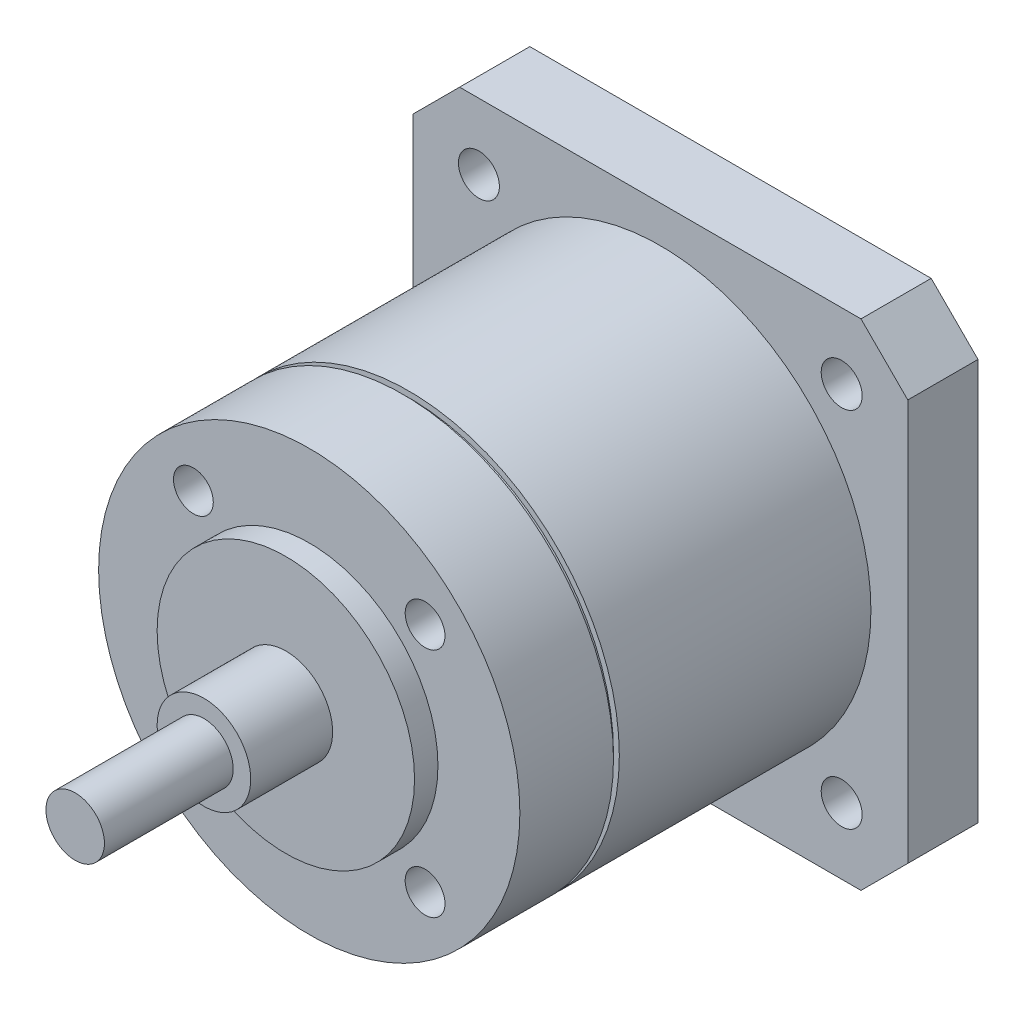
ISO-10303-21;
HEADER;
FILE_DESCRIPTION(('STEP AP214'),'2;1');
FILE_NAME('part.step','',(''),(''),'','','');
FILE_SCHEMA(('AUTOMOTIVE_DESIGN { 1 0 10303 214 1 1 1 1 }'));
ENDSEC;
DATA;
#1=APPLICATION_CONTEXT('core data for automotive mechanical design processes');
#2=APPLICATION_PROTOCOL_DEFINITION('international standard','automotive_design',2000,#1);
#3=PRODUCT_CONTEXT('',#1,'mechanical');
#4=PRODUCT('Part','Part','',(#3));
#5=PRODUCT_RELATED_PRODUCT_CATEGORY('part','',(#4));
#6=PRODUCT_DEFINITION_FORMATION('','',#4);
#7=PRODUCT_DEFINITION_CONTEXT('part definition',#1,'design');
#8=PRODUCT_DEFINITION('design','',#6,#7);
#9=PRODUCT_DEFINITION_SHAPE('','',#8);
#10=(LENGTH_UNIT() NAMED_UNIT(*) SI_UNIT(.MILLI.,.METRE.));
#11=(NAMED_UNIT(*) PLANE_ANGLE_UNIT() SI_UNIT($,.RADIAN.));
#12=(NAMED_UNIT(*) SI_UNIT($,.STERADIAN.) SOLID_ANGLE_UNIT());
#13=UNCERTAINTY_MEASURE_WITH_UNIT(LENGTH_MEASURE(1.E-05),#10,'distance_accuracy_value','');
#14=(GEOMETRIC_REPRESENTATION_CONTEXT(3) GLOBAL_UNCERTAINTY_ASSIGNED_CONTEXT((#13)) GLOBAL_UNIT_ASSIGNED_CONTEXT((#10,
#11,#12)) REPRESENTATION_CONTEXT('',''));
#15=CARTESIAN_POINT('',(0.,0.,0.));
#16=DIRECTION('',(0.,0.,1.));
#17=DIRECTION('',(1.,0.,0.));
#18=AXIS2_PLACEMENT_3D('',#15,#16,#17);
#19=CARTESIAN_POINT('',(0.,0.,56.));
#20=DIRECTION('',(0.,0.,1.));
#21=DIRECTION('',(1.,0.,0.));
#22=AXIS2_PLACEMENT_3D('',#19,#20,#21);
#23=PLANE('',#22);
#24=CARTESIAN_POINT('',(0.,0.,56.));
#25=DIRECTION('',(0.,0.,1.));
#26=DIRECTION('',(1.,0.,0.));
#27=AXIS2_PLACEMENT_3D('',#24,#25,#26);
#28=CIRCLE('',#27,2.5);
#29=CARTESIAN_POINT('',(2.5,0.,56.));
#30=VERTEX_POINT('',#29);
#31=EDGE_CURVE('E20',#30,#30,#28,.F.);
#32=ORIENTED_EDGE('',*,*,#31,.F.);
#33=EDGE_LOOP('',(#32));
#34=FACE_BOUND('',#33,.T.);
#35=ADVANCED_FACE('F17',(#34),#23,.T.);
#36=CARTESIAN_POINT('',(0.,0.,45.));
#37=DIRECTION('',(0.,0.,1.));
#38=DIRECTION('',(1.,0.,0.));
#39=AXIS2_PLACEMENT_3D('',#36,#37,#38);
#40=CYLINDRICAL_SURFACE('',#39,2.5);
#41=ORIENTED_EDGE('',*,*,#31,.T.);
#42=EDGE_LOOP('',(#41));
#43=FACE_BOUND('',#42,.T.);
#44=CARTESIAN_POINT('',(0.,0.,45.));
#45=DIRECTION('',(0.,0.,1.));
#46=DIRECTION('',(1.,0.,0.));
#47=AXIS2_PLACEMENT_3D('',#44,#45,#46);
#48=CIRCLE('',#47,2.5);
#49=CARTESIAN_POINT('',(2.5,0.,45.));
#50=VERTEX_POINT('',#49);
#51=EDGE_CURVE('E190',#50,#50,#48,.F.);
#52=ORIENTED_EDGE('',*,*,#51,.F.);
#53=EDGE_LOOP('',(#52));
#54=FACE_BOUND('',#53,.T.);
#55=ADVANCED_FACE('F197',(#43,#54),#40,.T.);
#56=CARTESIAN_POINT('',(0.,0.,45.));
#57=DIRECTION('',(0.,0.,1.));
#58=DIRECTION('',(1.,0.,0.));
#59=AXIS2_PLACEMENT_3D('',#56,#57,#58);
#60=PLANE('',#59);
#61=ORIENTED_EDGE('',*,*,#51,.T.);
#62=EDGE_LOOP('',(#61));
#63=FACE_BOUND('',#62,.T.);
#64=CARTESIAN_POINT('',(0.,0.,45.));
#65=DIRECTION('',(0.,0.,-1.));
#66=DIRECTION('',(-1.,0.,0.));
#67=AXIS2_PLACEMENT_3D('',#64,#65,#66);
#68=CIRCLE('',#67,4.);
#69=CARTESIAN_POINT('',(-4.,0.,45.));
#70=VERTEX_POINT('',#69);
#71=EDGE_CURVE('E188',#70,#70,#68,.T.);
#72=ORIENTED_EDGE('',*,*,#71,.F.);
#73=EDGE_LOOP('',(#72));
#74=FACE_BOUND('',#73,.T.);
#75=ADVANCED_FACE('F205',(#63,#74),#60,.T.);
#76=CARTESIAN_POINT('',(0.,0.,56.));
#77=DIRECTION('',(0.,0.,-1.));
#78=DIRECTION('',(-1.,0.,0.));
#79=AXIS2_PLACEMENT_3D('',#76,#77,#78);
#80=CYLINDRICAL_SURFACE('',#79,4.);
#81=ORIENTED_EDGE('',*,*,#71,.T.);
#82=EDGE_LOOP('',(#81));
#83=FACE_BOUND('',#82,.T.);
#84=CARTESIAN_POINT('',(0.,0.,38.));
#85=DIRECTION('',(0.,0.,-1.));
#86=DIRECTION('',(-1.,0.,0.));
#87=AXIS2_PLACEMENT_3D('',#84,#85,#86);
#88=CIRCLE('',#87,4.);
#89=CARTESIAN_POINT('',(-4.,0.,38.));
#90=VERTEX_POINT('',#89);
#91=EDGE_CURVE('E185',#90,#90,#88,.T.);
#92=ORIENTED_EDGE('',*,*,#91,.F.);
#93=EDGE_LOOP('',(#92));
#94=FACE_BOUND('',#93,.T.);
#95=ADVANCED_FACE('F331',(#83,#94),#80,.T.);
#96=CARTESIAN_POINT('',(0.,0.,38.));
#97=DIRECTION('',(0.,0.,1.));
#98=DIRECTION('',(1.,0.,0.));
#99=AXIS2_PLACEMENT_3D('',#96,#97,#98);
#100=PLANE('',#99);
#101=CARTESIAN_POINT('',(0.,0.,38.));
#102=DIRECTION('',(0.,0.,-1.));
#103=DIRECTION('',(-1.,0.,0.));
#104=AXIS2_PLACEMENT_3D('',#101,#102,#103);
#105=CIRCLE('',#104,11.);
#106=CARTESIAN_POINT('',(-11.,0.,38.));
#107=VERTEX_POINT('',#106);
#108=EDGE_CURVE('E182',#107,#107,#105,.T.);
#109=ORIENTED_EDGE('',*,*,#108,.F.);
#110=EDGE_LOOP('',(#109));
#111=FACE_BOUND('',#110,.T.);
#112=ORIENTED_EDGE('',*,*,#91,.T.);
#113=EDGE_LOOP('',(#112));
#114=FACE_BOUND('',#113,.T.);
#115=ADVANCED_FACE('F327',(#111,#114),#100,.T.);
#116=CARTESIAN_POINT('',(-9.90000000000004,9.9,26.));
#117=DIRECTION('',(0.,0.,1.));
#118=DIRECTION('',(1.,0.,0.));
#119=AXIS2_PLACEMENT_3D('',#116,#117,#118);
#120=PLANE('',#119);
#121=CARTESIAN_POINT('',(-9.90000000000004,9.9,26.));
#122=DIRECTION('',(0.,0.,1.));
#123=DIRECTION('',(1.,0.,0.));
#124=AXIS2_PLACEMENT_3D('',#121,#122,#123);
#125=CIRCLE('',#124,1.7);
#126=CARTESIAN_POINT('',(-8.20000000000004,9.9,26.));
#127=VERTEX_POINT('',#126);
#128=EDGE_CURVE('E179',#127,#127,#125,.T.);
#129=ORIENTED_EDGE('',*,*,#128,.T.);
#130=EDGE_LOOP('',(#129));
#131=FACE_BOUND('',#130,.T.);
#132=ADVANCED_FACE('F323',(#131),#120,.T.);
#133=CARTESIAN_POINT('',(9.90000000000004,9.90000000000001,26.));
#134=DIRECTION('',(0.,0.,1.));
#135=DIRECTION('',(1.,0.,0.));
#136=AXIS2_PLACEMENT_3D('',#133,#134,#135);
#137=PLANE('',#136);
#138=CARTESIAN_POINT('',(9.90000000000004,9.90000000000001,26.));
#139=DIRECTION('',(0.,0.,1.));
#140=DIRECTION('',(1.,0.,0.));
#141=AXIS2_PLACEMENT_3D('',#138,#139,#140);
#142=CIRCLE('',#141,1.7);
#143=CARTESIAN_POINT('',(11.6,9.90000000000001,26.));
#144=VERTEX_POINT('',#143);
#145=EDGE_CURVE('E176',#144,#144,#142,.T.);
#146=ORIENTED_EDGE('',*,*,#145,.T.);
#147=EDGE_LOOP('',(#146));
#148=FACE_BOUND('',#147,.T.);
#149=ADVANCED_FACE('F319',(#148),#137,.T.);
#150=CARTESIAN_POINT('',(9.90000000000004,-9.9,26.));
#151=DIRECTION('',(0.,0.,1.));
#152=DIRECTION('',(1.,0.,0.));
#153=AXIS2_PLACEMENT_3D('',#150,#151,#152);
#154=PLANE('',#153);
#155=CARTESIAN_POINT('',(9.90000000000004,-9.9,26.));
#156=DIRECTION('',(0.,0.,1.));
#157=DIRECTION('',(1.,0.,0.));
#158=AXIS2_PLACEMENT_3D('',#155,#156,#157);
#159=CIRCLE('',#158,1.7);
#160=CARTESIAN_POINT('',(11.6,-9.9,26.));
#161=VERTEX_POINT('',#160);
#162=EDGE_CURVE('E173',#161,#161,#159,.T.);
#163=ORIENTED_EDGE('',*,*,#162,.T.);
#164=EDGE_LOOP('',(#163));
#165=FACE_BOUND('',#164,.T.);
#166=ADVANCED_FACE('F315',(#165),#154,.T.);
#167=CARTESIAN_POINT('',(-9.90000000000011,-9.89999999999994,26.));
#168=DIRECTION('',(0.,0.,1.));
#169=DIRECTION('',(1.,0.,0.));
#170=AXIS2_PLACEMENT_3D('',#167,#168,#169);
#171=PLANE('',#170);
#172=CARTESIAN_POINT('',(-9.90000000000011,-9.89999999999994,26.));
#173=DIRECTION('',(0.,0.,1.));
#174=DIRECTION('',(1.,0.,0.));
#175=AXIS2_PLACEMENT_3D('',#172,#173,#174);
#176=CIRCLE('',#175,1.7);
#177=CARTESIAN_POINT('',(-8.2000000000001,-9.89999999999994,26.));
#178=VERTEX_POINT('',#177);
#179=EDGE_CURVE('E170',#178,#178,#176,.T.);
#180=ORIENTED_EDGE('',*,*,#179,.T.);
#181=EDGE_LOOP('',(#180));
#182=FACE_BOUND('',#181,.T.);
#183=ADVANCED_FACE('F311',(#182),#171,.T.);
#184=CARTESIAN_POINT('',(0.,0.,38.));
#185=DIRECTION('',(0.,0.,-1.));
#186=DIRECTION('',(-1.,0.,0.));
#187=AXIS2_PLACEMENT_3D('',#184,#185,#186);
#188=CYLINDRICAL_SURFACE('',#187,11.);
#189=ORIENTED_EDGE('',*,*,#108,.T.);
#190=EDGE_LOOP('',(#189));
#191=FACE_BOUND('',#190,.T.);
#192=CARTESIAN_POINT('',(0.,0.,36.));
#193=DIRECTION('',(0.,0.,-1.));
#194=DIRECTION('',(-1.,0.,0.));
#195=AXIS2_PLACEMENT_3D('',#192,#193,#194);
#196=CIRCLE('',#195,11.);
#197=CARTESIAN_POINT('',(-11.,0.,36.));
#198=VERTEX_POINT('',#197);
#199=EDGE_CURVE('E167',#198,#198,#196,.T.);
#200=ORIENTED_EDGE('',*,*,#199,.F.);
#201=EDGE_LOOP('',(#200));
#202=FACE_BOUND('',#201,.T.);
#203=ADVANCED_FACE('F307',(#191,#202),#188,.T.);
#204=CARTESIAN_POINT('',(-9.90000000000004,9.9,26.));
#205=DIRECTION('',(0.,0.,1.));
#206=DIRECTION('',(1.,0.,0.));
#207=AXIS2_PLACEMENT_3D('',#204,#205,#206);
#208=CYLINDRICAL_SURFACE('',#207,1.7);
#209=ORIENTED_EDGE('',*,*,#128,.F.);
#210=EDGE_LOOP('',(#209));
#211=FACE_BOUND('',#210,.T.);
#212=CARTESIAN_POINT('',(-9.90000000000004,9.9,36.));
#213=DIRECTION('',(0.,0.,1.));
#214=DIRECTION('',(1.,0.,0.));
#215=AXIS2_PLACEMENT_3D('',#212,#213,#214);
#216=CIRCLE('',#215,1.7);
#217=CARTESIAN_POINT('',(-8.20000000000004,9.9,36.));
#218=VERTEX_POINT('',#217);
#219=EDGE_CURVE('E164',#218,#218,#216,.F.);
#220=ORIENTED_EDGE('',*,*,#219,.F.);
#221=EDGE_LOOP('',(#220));
#222=FACE_BOUND('',#221,.T.);
#223=ADVANCED_FACE('F303',(#211,#222),#208,.F.);
#224=CARTESIAN_POINT('',(9.90000000000004,9.90000000000001,26.));
#225=DIRECTION('',(0.,0.,1.));
#226=DIRECTION('',(1.,0.,0.));
#227=AXIS2_PLACEMENT_3D('',#224,#225,#226);
#228=CYLINDRICAL_SURFACE('',#227,1.7);
#229=ORIENTED_EDGE('',*,*,#145,.F.);
#230=EDGE_LOOP('',(#229));
#231=FACE_BOUND('',#230,.T.);
#232=CARTESIAN_POINT('',(9.90000000000004,9.90000000000001,36.));
#233=DIRECTION('',(0.,0.,1.));
#234=DIRECTION('',(1.,0.,0.));
#235=AXIS2_PLACEMENT_3D('',#232,#233,#234);
#236=CIRCLE('',#235,1.7);
#237=CARTESIAN_POINT('',(11.6,9.90000000000001,36.));
#238=VERTEX_POINT('',#237);
#239=EDGE_CURVE('E161',#238,#238,#236,.F.);
#240=ORIENTED_EDGE('',*,*,#239,.F.);
#241=EDGE_LOOP('',(#240));
#242=FACE_BOUND('',#241,.T.);
#243=ADVANCED_FACE('F299',(#231,#242),#228,.F.);
#244=CARTESIAN_POINT('',(9.90000000000004,-9.9,26.));
#245=DIRECTION('',(0.,0.,1.));
#246=DIRECTION('',(1.,0.,0.));
#247=AXIS2_PLACEMENT_3D('',#244,#245,#246);
#248=CYLINDRICAL_SURFACE('',#247,1.7);
#249=ORIENTED_EDGE('',*,*,#162,.F.);
#250=EDGE_LOOP('',(#249));
#251=FACE_BOUND('',#250,.T.);
#252=CARTESIAN_POINT('',(9.90000000000004,-9.9,36.));
#253=DIRECTION('',(0.,0.,1.));
#254=DIRECTION('',(1.,0.,0.));
#255=AXIS2_PLACEMENT_3D('',#252,#253,#254);
#256=CIRCLE('',#255,1.7);
#257=CARTESIAN_POINT('',(11.6,-9.9,36.));
#258=VERTEX_POINT('',#257);
#259=EDGE_CURVE('E158',#258,#258,#256,.F.);
#260=ORIENTED_EDGE('',*,*,#259,.F.);
#261=EDGE_LOOP('',(#260));
#262=FACE_BOUND('',#261,.T.);
#263=ADVANCED_FACE('F295',(#251,#262),#248,.F.);
#264=CARTESIAN_POINT('',(-9.90000000000011,-9.89999999999994,26.));
#265=DIRECTION('',(0.,0.,1.));
#266=DIRECTION('',(1.,0.,0.));
#267=AXIS2_PLACEMENT_3D('',#264,#265,#266);
#268=CYLINDRICAL_SURFACE('',#267,1.7);
#269=ORIENTED_EDGE('',*,*,#179,.F.);
#270=EDGE_LOOP('',(#269));
#271=FACE_BOUND('',#270,.T.);
#272=CARTESIAN_POINT('',(-9.90000000000011,-9.89999999999994,36.));
#273=DIRECTION('',(0.,0.,1.));
#274=DIRECTION('',(1.,0.,0.));
#275=AXIS2_PLACEMENT_3D('',#272,#273,#274);
#276=CIRCLE('',#275,1.7);
#277=CARTESIAN_POINT('',(-8.2000000000001,-9.89999999999994,36.));
#278=VERTEX_POINT('',#277);
#279=EDGE_CURVE('E155',#278,#278,#276,.F.);
#280=ORIENTED_EDGE('',*,*,#279,.F.);
#281=EDGE_LOOP('',(#280));
#282=FACE_BOUND('',#281,.T.);
#283=ADVANCED_FACE('F291',(#271,#282),#268,.F.);
#284=CARTESIAN_POINT('',(0.,0.,36.));
#285=DIRECTION('',(0.,0.,1.));
#286=DIRECTION('',(1.,0.,0.));
#287=AXIS2_PLACEMENT_3D('',#284,#285,#286);
#288=PLANE('',#287);
#289=ORIENTED_EDGE('',*,*,#279,.T.);
#290=EDGE_LOOP('',(#289));
#291=FACE_BOUND('',#290,.T.);
#292=ORIENTED_EDGE('',*,*,#259,.T.);
#293=EDGE_LOOP('',(#292));
#294=FACE_BOUND('',#293,.T.);
#295=ORIENTED_EDGE('',*,*,#239,.T.);
#296=EDGE_LOOP('',(#295));
#297=FACE_BOUND('',#296,.T.);
#298=ORIENTED_EDGE('',*,*,#219,.T.);
#299=EDGE_LOOP('',(#298));
#300=FACE_BOUND('',#299,.T.);
#301=CARTESIAN_POINT('',(0.,0.,36.));
#302=DIRECTION('',(0.,0.,-1.));
#303=DIRECTION('',(-1.,0.,0.));
#304=AXIS2_PLACEMENT_3D('',#301,#302,#303);
#305=CIRCLE('',#304,18.);
#306=CARTESIAN_POINT('',(-18.,0.,36.));
#307=VERTEX_POINT('',#306);
#308=EDGE_CURVE('E152',#307,#307,#305,.T.);
#309=ORIENTED_EDGE('',*,*,#308,.F.);
#310=EDGE_LOOP('',(#309));
#311=FACE_BOUND('',#310,.T.);
#312=ORIENTED_EDGE('',*,*,#199,.T.);
#313=EDGE_LOOP('',(#312));
#314=FACE_BOUND('',#313,.T.);
#315=ADVANCED_FACE('F287',(#291,#294,#297,#300,#311,#314),#288,.T.);
#316=CARTESIAN_POINT('',(0.,0.,36.));
#317=DIRECTION('',(0.,0.,-1.));
#318=DIRECTION('',(-1.,0.,0.));
#319=AXIS2_PLACEMENT_3D('',#316,#317,#318);
#320=CYLINDRICAL_SURFACE('',#319,18.);
#321=ORIENTED_EDGE('',*,*,#308,.T.);
#322=EDGE_LOOP('',(#321));
#323=FACE_BOUND('',#322,.T.);
#324=CARTESIAN_POINT('',(0.,0.,28.));
#325=DIRECTION('',(0.,0.,-1.));
#326=DIRECTION('',(-1.,0.,0.));
#327=AXIS2_PLACEMENT_3D('',#324,#325,#326);
#328=CIRCLE('',#327,18.);
#329=CARTESIAN_POINT('',(-18.,0.,28.));
#330=VERTEX_POINT('',#329);
#331=EDGE_CURVE('E149',#330,#330,#328,.T.);
#332=ORIENTED_EDGE('',*,*,#331,.F.);
#333=EDGE_LOOP('',(#332));
#334=FACE_BOUND('',#333,.T.);
#335=ADVANCED_FACE('F283',(#323,#334),#320,.T.);
#336=CARTESIAN_POINT('',(0.,18.,28.));
#337=DIRECTION('',(0.,0.,-1.));
#338=DIRECTION('',(-1.,0.,0.));
#339=AXIS2_PLACEMENT_3D('',#336,#337,#338);
#340=PLANE('',#339);
#341=CARTESIAN_POINT('',(0.,0.,28.));
#342=DIRECTION('',(0.,0.,1.));
#343=DIRECTION('',(1.,0.,0.));
#344=AXIS2_PLACEMENT_3D('',#341,#342,#343);
#345=CIRCLE('',#344,17.5);
#346=CARTESIAN_POINT('',(17.5,0.,28.));
#347=VERTEX_POINT('',#346);
#348=EDGE_CURVE('E146',#347,#347,#345,.F.);
#349=ORIENTED_EDGE('',*,*,#348,.F.);
#350=EDGE_LOOP('',(#349));
#351=FACE_BOUND('',#350,.T.);
#352=ORIENTED_EDGE('',*,*,#331,.T.);
#353=EDGE_LOOP('',(#352));
#354=FACE_BOUND('',#353,.T.);
#355=ADVANCED_FACE('F279',(#351,#354),#340,.T.);
#356=CARTESIAN_POINT('',(0.,0.,56.));
#357=DIRECTION('',(0.,0.,1.));
#358=DIRECTION('',(1.,0.,0.));
#359=AXIS2_PLACEMENT_3D('',#356,#357,#358);
#360=CYLINDRICAL_SURFACE('',#359,17.5);
#361=ORIENTED_EDGE('',*,*,#348,.T.);
#362=EDGE_LOOP('',(#361));
#363=FACE_BOUND('',#362,.T.);
#364=CARTESIAN_POINT('',(0.,0.,27.5));
#365=DIRECTION('',(0.,0.,1.));
#366=DIRECTION('',(1.,0.,0.));
#367=AXIS2_PLACEMENT_3D('',#364,#365,#366);
#368=CIRCLE('',#367,17.5);
#369=CARTESIAN_POINT('',(17.5,0.,27.5));
#370=VERTEX_POINT('',#369);
#371=EDGE_CURVE('E143',#370,#370,#368,.F.);
#372=ORIENTED_EDGE('',*,*,#371,.F.);
#373=EDGE_LOOP('',(#372));
#374=FACE_BOUND('',#373,.T.);
#375=ADVANCED_FACE('F275',(#363,#374),#360,.T.);
#376=CARTESIAN_POINT('',(0.,18.,27.5));
#377=DIRECTION('',(0.,0.,1.));
#378=DIRECTION('',(1.,0.,0.));
#379=AXIS2_PLACEMENT_3D('',#376,#377,#378);
#380=PLANE('',#379);
#381=CARTESIAN_POINT('',(0.,0.,27.5));
#382=DIRECTION('',(0.,0.,-1.));
#383=DIRECTION('',(-1.,0.,0.));
#384=AXIS2_PLACEMENT_3D('',#381,#382,#383);
#385=CIRCLE('',#384,18.);
#386=CARTESIAN_POINT('',(-18.,0.,27.5));
#387=VERTEX_POINT('',#386);
#388=EDGE_CURVE('E140',#387,#387,#385,.T.);
#389=ORIENTED_EDGE('',*,*,#388,.F.);
#390=EDGE_LOOP('',(#389));
#391=FACE_BOUND('',#390,.T.);
#392=ORIENTED_EDGE('',*,*,#371,.T.);
#393=EDGE_LOOP('',(#392));
#394=FACE_BOUND('',#393,.T.);
#395=ADVANCED_FACE('F271',(#391,#394),#380,.T.);
#396=CARTESIAN_POINT('',(0.,0.,36.));
#397=DIRECTION('',(0.,0.,-1.));
#398=DIRECTION('',(-1.,0.,0.));
#399=AXIS2_PLACEMENT_3D('',#396,#397,#398);
#400=CYLINDRICAL_SURFACE('',#399,18.);
#401=ORIENTED_EDGE('',*,*,#388,.T.);
#402=EDGE_LOOP('',(#401));
#403=FACE_BOUND('',#402,.T.);
#404=CARTESIAN_POINT('',(0.,0.,6.));
#405=DIRECTION('',(0.,0.,-1.));
#406=DIRECTION('',(-1.,0.,0.));
#407=AXIS2_PLACEMENT_3D('',#404,#405,#406);
#408=CIRCLE('',#407,18.);
#409=CARTESIAN_POINT('',(-18.,0.,6.));
#410=VERTEX_POINT('',#409);
#411=EDGE_CURVE('E99',#410,#410,#408,.F.);
#412=ORIENTED_EDGE('',*,*,#411,.T.);
#413=EDGE_LOOP('',(#412));
#414=FACE_BOUND('',#413,.T.);
#415=ADVANCED_FACE('F267',(#403,#414),#400,.T.);
#416=CARTESIAN_POINT('',(0.,0.,20.));
#417=DIRECTION('',(0.,0.,-1.));
#418=DIRECTION('',(-1.,0.,0.));
#419=AXIS2_PLACEMENT_3D('',#416,#417,#418);
#420=PLANE('',#419);
#421=CARTESIAN_POINT('',(0.,0.,20.));
#422=DIRECTION('',(0.,0.,-1.));
#423=DIRECTION('',(-1.,0.,0.));
#424=AXIS2_PLACEMENT_3D('',#421,#422,#423);
#425=CIRCLE('',#424,4.);
#426=CARTESIAN_POINT('',(-4.,0.,20.));
#427=VERTEX_POINT('',#426);
#428=EDGE_CURVE('E135',#427,#427,#425,.T.);
#429=ORIENTED_EDGE('',*,*,#428,.T.);
#430=EDGE_LOOP('',(#429));
#431=FACE_BOUND('',#430,.T.);
#432=ADVANCED_FACE('F263',(#431),#420,.T.);
#433=CARTESIAN_POINT('',(-21.15,21.15,6.));
#434=DIRECTION('',(0.,0.,-1.));
#435=DIRECTION('',(-1.,0.,0.));
#436=AXIS2_PLACEMENT_3D('',#433,#434,#435);
#437=PLANE('',#436);
#438=CARTESIAN_POINT('',(-15.5,-15.5,6.));
#439=DIRECTION('',(0.,0.,-1.));
#440=DIRECTION('',(-1.,0.,0.));
#441=AXIS2_PLACEMENT_3D('',#438,#439,#440);
#442=CIRCLE('',#441,1.75);
#443=CARTESIAN_POINT('',(-17.25,-15.5,6.));
#444=VERTEX_POINT('',#443);
#445=EDGE_CURVE('E122',#444,#444,#442,.T.);
#446=ORIENTED_EDGE('',*,*,#445,.T.);
#447=EDGE_LOOP('',(#446));
#448=FACE_BOUND('',#447,.T.);
#449=CARTESIAN_POINT('',(15.5,-15.5,6.));
#450=DIRECTION('',(0.,0.,-1.));
#451=DIRECTION('',(-1.,0.,0.));
#452=AXIS2_PLACEMENT_3D('',#449,#450,#451);
#453=CIRCLE('',#452,1.75);
#454=CARTESIAN_POINT('',(13.75,-15.5,6.));
#455=VERTEX_POINT('',#454);
#456=EDGE_CURVE('E126',#455,#455,#453,.T.);
#457=ORIENTED_EDGE('',*,*,#456,.T.);
#458=EDGE_LOOP('',(#457));
#459=FACE_BOUND('',#458,.T.);
#460=CARTESIAN_POINT('',(15.5,15.5,6.));
#461=DIRECTION('',(0.,0.,-1.));
#462=DIRECTION('',(-1.,0.,0.));
#463=AXIS2_PLACEMENT_3D('',#460,#461,#462);
#464=CIRCLE('',#463,1.75);
#465=CARTESIAN_POINT('',(13.75,15.5,6.));
#466=VERTEX_POINT('',#465);
#467=EDGE_CURVE('E129',#466,#466,#464,.T.);
#468=ORIENTED_EDGE('',*,*,#467,.T.);
#469=EDGE_LOOP('',(#468));
#470=FACE_BOUND('',#469,.T.);
#471=CARTESIAN_POINT('',(-15.5,15.5,6.));
#472=DIRECTION('',(0.,0.,-1.));
#473=DIRECTION('',(-1.,0.,0.));
#474=AXIS2_PLACEMENT_3D('',#471,#472,#473);
#475=CIRCLE('',#474,1.75);
#476=CARTESIAN_POINT('',(-17.25,15.5,6.));
#477=VERTEX_POINT('',#476);
#478=EDGE_CURVE('E132',#477,#477,#475,.T.);
#479=ORIENTED_EDGE('',*,*,#478,.T.);
#480=EDGE_LOOP('',(#479));
#481=FACE_BOUND('',#480,.T.);
#482=DIRECTION('',(1.,0.,0.));
#483=VECTOR('',#482,1.);
#484=CARTESIAN_POINT('',(17.15,-21.15,6.));
#485=LINE('',#484,#483);
#486=CARTESIAN_POINT('',(-17.15,-21.15,6.));
#487=VERTEX_POINT('',#486);
#488=CARTESIAN_POINT('',(17.15,-21.15,6.));
#489=VERTEX_POINT('',#488);
#490=EDGE_CURVE('E86',#487,#489,#485,.T.);
#491=ORIENTED_EDGE('',*,*,#490,.T.);
#492=DIRECTION('',(-0.707106781186549,-0.707106781186546,0.));
#493=VECTOR('',#492,1.);
#494=CARTESIAN_POINT('',(21.15,-17.15,6.));
#495=LINE('',#494,#493);
#496=CARTESIAN_POINT('',(21.15,-17.15,6.));
#497=VERTEX_POINT('',#496);
#498=EDGE_CURVE('E729',#489,#497,#495,.F.);
#499=ORIENTED_EDGE('',*,*,#498,.T.);
#500=DIRECTION('',(0.,-1.,0.));
#501=VECTOR('',#500,1.);
#502=CARTESIAN_POINT('',(21.15,17.15,6.));
#503=LINE('',#502,#501);
#504=CARTESIAN_POINT('',(21.15,17.15,6.));
#505=VERTEX_POINT('',#504);
#506=EDGE_CURVE('E734',#497,#505,#503,.F.);
#507=ORIENTED_EDGE('',*,*,#506,.T.);
#508=DIRECTION('',(0.707106781186547,-0.707106781186548,0.));
#509=VECTOR('',#508,1.);
#510=CARTESIAN_POINT('',(17.15,21.15,6.));
#511=LINE('',#510,#509);
#512=CARTESIAN_POINT('',(17.15,21.15,6.));
#513=VERTEX_POINT('',#512);
#514=EDGE_CURVE('E738',#505,#513,#511,.F.);
#515=ORIENTED_EDGE('',*,*,#514,.T.);
#516=DIRECTION('',(1.,0.,0.));
#517=VECTOR('',#516,1.);
#518=CARTESIAN_POINT('',(-17.15,21.15,6.));
#519=LINE('',#518,#517);
#520=CARTESIAN_POINT('',(-17.15,21.15,6.));
#521=VERTEX_POINT('',#520);
#522=EDGE_CURVE('E742',#513,#521,#519,.F.);
#523=ORIENTED_EDGE('',*,*,#522,.T.);
#524=DIRECTION('',(0.707106781186549,0.707106781186546,0.));
#525=VECTOR('',#524,1.);
#526=CARTESIAN_POINT('',(-21.15,17.15,6.));
#527=LINE('',#526,#525);
#528=CARTESIAN_POINT('',(-21.15,17.15,6.));
#529=VERTEX_POINT('',#528);
#530=EDGE_CURVE('E746',#521,#529,#527,.F.);
#531=ORIENTED_EDGE('',*,*,#530,.T.);
#532=DIRECTION('',(0.,1.,0.));
#533=VECTOR('',#532,1.);
#534=CARTESIAN_POINT('',(-21.15,-17.15,6.));
#535=LINE('',#534,#533);
#536=CARTESIAN_POINT('',(-21.15,-17.15,6.));
#537=VERTEX_POINT('',#536);
#538=EDGE_CURVE('E80',#529,#537,#535,.F.);
#539=ORIENTED_EDGE('',*,*,#538,.T.);
#540=DIRECTION('',(-0.707106781186546,0.707106781186549,0.));
#541=VECTOR('',#540,1.);
#542=CARTESIAN_POINT('',(-17.15,-21.15,6.));
#543=LINE('',#542,#541);
#544=EDGE_CURVE('E82',#537,#487,#543,.F.);
#545=ORIENTED_EDGE('',*,*,#544,.T.);
#546=EDGE_LOOP('',(#491,#499,#507,#515,#523,#531,#539,#545));
#547=FACE_BOUND('',#546,.T.);
#548=ORIENTED_EDGE('',*,*,#411,.F.);
#549=EDGE_LOOP('',(#548));
#550=FACE_BOUND('',#549,.T.);
#551=ADVANCED_FACE('F84',(#448,#459,#470,#481,#547,#550),#437,.F.);
#552=CARTESIAN_POINT('',(17.15,-21.15,6.));
#553=DIRECTION('',(0.,1.,0.));
#554=DIRECTION('',(0.,0.,1.));
#555=AXIS2_PLACEMENT_3D('',#552,#553,#554);
#556=PLANE('',#555);
#557=ORIENTED_EDGE('',*,*,#490,.F.);
#558=DIRECTION('',(0.,0.,1.));
#559=VECTOR('',#558,1.);
#560=CARTESIAN_POINT('',(-17.15,-21.15,6.));
#561=LINE('',#560,#559);
#562=CARTESIAN_POINT('',(-17.15,-21.15,0.));
#563=VERTEX_POINT('',#562);
#564=EDGE_CURVE('E91',#487,#563,#561,.F.);
#565=ORIENTED_EDGE('',*,*,#564,.T.);
#566=DIRECTION('',(-1.,0.,0.));
#567=VECTOR('',#566,1.);
#568=CARTESIAN_POINT('',(-21.15,-21.15,0.));
#569=LINE('',#568,#567);
#570=CARTESIAN_POINT('',(17.15,-21.15,0.));
#571=VERTEX_POINT('',#570);
#572=EDGE_CURVE('E125',#571,#563,#569,.T.);
#573=ORIENTED_EDGE('',*,*,#572,.F.);
#574=DIRECTION('',(0.,0.,1.));
#575=VECTOR('',#574,1.);
#576=CARTESIAN_POINT('',(17.15,-21.15,6.));
#577=LINE('',#576,#575);
#578=EDGE_CURVE('E97',#571,#489,#577,.T.);
#579=ORIENTED_EDGE('',*,*,#578,.T.);
#580=EDGE_LOOP('',(#557,#565,#573,#579));
#581=FACE_BOUND('',#580,.T.);
#582=ADVANCED_FACE('F94',(#581),#556,.F.);
#583=CARTESIAN_POINT('',(-17.15,-21.15,6.));
#584=DIRECTION('',(0.707106781186549,0.707106781186546,0.));
#585=DIRECTION('',(-0.707106781186546,0.707106781186549,0.));
#586=AXIS2_PLACEMENT_3D('',#583,#584,#585);
#587=PLANE('',#586);
#588=ORIENTED_EDGE('',*,*,#544,.F.);
#589=DIRECTION('',(0.,0.,1.));
#590=VECTOR('',#589,1.);
#591=CARTESIAN_POINT('',(-21.15,-17.15,6.));
#592=LINE('',#591,#590);
#593=CARTESIAN_POINT('',(-21.15,-17.15,0.));
#594=VERTEX_POINT('',#593);
#595=EDGE_CURVE('E106',#537,#594,#592,.F.);
#596=ORIENTED_EDGE('',*,*,#595,.T.);
#597=DIRECTION('',(-0.707106781186546,0.707106781186549,0.));
#598=VECTOR('',#597,1.);
#599=CARTESIAN_POINT('',(-17.15,-21.15,0.));
#600=LINE('',#599,#598);
#601=EDGE_CURVE('E103',#563,#594,#600,.T.);
#602=ORIENTED_EDGE('',*,*,#601,.F.);
#603=ORIENTED_EDGE('',*,*,#564,.F.);
#604=EDGE_LOOP('',(#588,#596,#602,#603));
#605=FACE_BOUND('',#604,.T.);
#606=ADVANCED_FACE('F101',(#605),#587,.F.);
#607=CARTESIAN_POINT('',(-21.15,-17.15,6.));
#608=DIRECTION('',(1.,0.,0.));
#609=DIRECTION('',(0.,1.,0.));
#610=AXIS2_PLACEMENT_3D('',#607,#608,#609);
#611=PLANE('',#610);
#612=ORIENTED_EDGE('',*,*,#538,.F.);
#613=DIRECTION('',(0.,0.,1.));
#614=VECTOR('',#613,1.);
#615=CARTESIAN_POINT('',(-21.15,17.15,6.));
#616=LINE('',#615,#614);
#617=CARTESIAN_POINT('',(-21.15,17.15,0.));
#618=VERTEX_POINT('',#617);
#619=EDGE_CURVE('E744',#529,#618,#616,.F.);
#620=ORIENTED_EDGE('',*,*,#619,.T.);
#621=DIRECTION('',(0.,1.,0.));
#622=VECTOR('',#621,1.);
#623=CARTESIAN_POINT('',(-21.15,21.15,0.));
#624=LINE('',#623,#622);
#625=EDGE_CURVE('E723',#594,#618,#624,.T.);
#626=ORIENTED_EDGE('',*,*,#625,.F.);
#627=ORIENTED_EDGE('',*,*,#595,.F.);
#628=EDGE_LOOP('',(#612,#620,#626,#627));
#629=FACE_BOUND('',#628,.T.);
#630=ADVANCED_FACE('F252',(#629),#611,.F.);
#631=CARTESIAN_POINT('',(-21.15,17.15,6.));
#632=DIRECTION('',(0.707106781186546,-0.707106781186549,0.));
#633=DIRECTION('',(0.707106781186549,0.707106781186546,0.));
#634=AXIS2_PLACEMENT_3D('',#631,#632,#633);
#635=PLANE('',#634);
#636=ORIENTED_EDGE('',*,*,#530,.F.);
#637=DIRECTION('',(0.,0.,1.));
#638=VECTOR('',#637,1.);
#639=CARTESIAN_POINT('',(-17.15,21.15,6.));
#640=LINE('',#639,#638);
#641=CARTESIAN_POINT('',(-17.15,21.15,0.));
#642=VERTEX_POINT('',#641);
#643=EDGE_CURVE('E740',#521,#642,#640,.F.);
#644=ORIENTED_EDGE('',*,*,#643,.T.);
#645=DIRECTION('',(0.707106781186549,0.707106781186546,0.));
#646=VECTOR('',#645,1.);
#647=CARTESIAN_POINT('',(-21.15,17.15,0.));
#648=LINE('',#647,#646);
#649=EDGE_CURVE('E720',#618,#642,#648,.T.);
#650=ORIENTED_EDGE('',*,*,#649,.F.);
#651=ORIENTED_EDGE('',*,*,#619,.F.);
#652=EDGE_LOOP('',(#636,#644,#650,#651));
#653=FACE_BOUND('',#652,.T.);
#654=ADVANCED_FACE('F248',(#653),#635,.F.);
#655=CARTESIAN_POINT('',(-17.15,21.15,6.));
#656=DIRECTION('',(0.,-1.,0.));
#657=DIRECTION('',(1.,0.,0.));
#658=AXIS2_PLACEMENT_3D('',#655,#656,#657);
#659=PLANE('',#658);
#660=ORIENTED_EDGE('',*,*,#522,.F.);
#661=DIRECTION('',(0.,0.,1.));
#662=VECTOR('',#661,1.);
#663=CARTESIAN_POINT('',(17.15,21.15,6.));
#664=LINE('',#663,#662);
#665=CARTESIAN_POINT('',(17.15,21.15,0.));
#666=VERTEX_POINT('',#665);
#667=EDGE_CURVE('E736',#513,#666,#664,.F.);
#668=ORIENTED_EDGE('',*,*,#667,.T.);
#669=DIRECTION('',(-1.,0.,0.));
#670=VECTOR('',#669,1.);
#671=CARTESIAN_POINT('',(-21.15,21.15,0.));
#672=LINE('',#671,#670);
#673=EDGE_CURVE('E716',#642,#666,#672,.F.);
#674=ORIENTED_EDGE('',*,*,#673,.F.);
#675=ORIENTED_EDGE('',*,*,#643,.F.);
#676=EDGE_LOOP('',(#660,#668,#674,#675));
#677=FACE_BOUND('',#676,.T.);
#678=ADVANCED_FACE('F244',(#677),#659,.F.);
#679=CARTESIAN_POINT('',(17.15,21.15,6.));
#680=DIRECTION('',(-0.707106781186548,-0.707106781186547,0.));
#681=DIRECTION('',(0.707106781186547,-0.707106781186548,0.));
#682=AXIS2_PLACEMENT_3D('',#679,#680,#681);
#683=PLANE('',#682);
#684=ORIENTED_EDGE('',*,*,#514,.F.);
#685=DIRECTION('',(0.,0.,1.));
#686=VECTOR('',#685,1.);
#687=CARTESIAN_POINT('',(21.15,17.15,6.));
#688=LINE('',#687,#686);
#689=CARTESIAN_POINT('',(21.15,17.15,0.));
#690=VERTEX_POINT('',#689);
#691=EDGE_CURVE('E732',#505,#690,#688,.F.);
#692=ORIENTED_EDGE('',*,*,#691,.T.);
#693=DIRECTION('',(0.707106781186547,-0.707106781186548,0.));
#694=VECTOR('',#693,1.);
#695=CARTESIAN_POINT('',(17.15,21.15,0.));
#696=LINE('',#695,#694);
#697=EDGE_CURVE('E712',#666,#690,#696,.T.);
#698=ORIENTED_EDGE('',*,*,#697,.F.);
#699=ORIENTED_EDGE('',*,*,#667,.F.);
#700=EDGE_LOOP('',(#684,#692,#698,#699));
#701=FACE_BOUND('',#700,.T.);
#702=ADVANCED_FACE('F241',(#701),#683,.F.);
#703=CARTESIAN_POINT('',(21.15,17.15,6.));
#704=DIRECTION('',(-1.,0.,0.));
#705=DIRECTION('',(0.,-1.,0.));
#706=AXIS2_PLACEMENT_3D('',#703,#704,#705);
#707=PLANE('',#706);
#708=ORIENTED_EDGE('',*,*,#506,.F.);
#709=DIRECTION('',(0.,0.,1.));
#710=VECTOR('',#709,1.);
#711=CARTESIAN_POINT('',(21.15,-17.15,6.));
#712=LINE('',#711,#710);
#713=CARTESIAN_POINT('',(21.15,-17.15,0.));
#714=VERTEX_POINT('',#713);
#715=EDGE_CURVE('E35',#497,#714,#712,.F.);
#716=ORIENTED_EDGE('',*,*,#715,.T.);
#717=DIRECTION('',(0.,1.,0.));
#718=VECTOR('',#717,1.);
#719=CARTESIAN_POINT('',(21.15,21.15,0.));
#720=LINE('',#719,#718);
#721=EDGE_CURVE('E709',#690,#714,#720,.F.);
#722=ORIENTED_EDGE('',*,*,#721,.F.);
#723=ORIENTED_EDGE('',*,*,#691,.F.);
#724=EDGE_LOOP('',(#708,#716,#722,#723));
#725=FACE_BOUND('',#724,.T.);
#726=ADVANCED_FACE('F237',(#725),#707,.F.);
#727=CARTESIAN_POINT('',(21.15,-17.15,6.));
#728=DIRECTION('',(-0.707106781186546,0.707106781186549,0.));
#729=DIRECTION('',(-0.707106781186549,-0.707106781186546,0.));
#730=AXIS2_PLACEMENT_3D('',#727,#728,#729);
#731=PLANE('',#730);
#732=ORIENTED_EDGE('',*,*,#498,.F.);
#733=ORIENTED_EDGE('',*,*,#578,.F.);
#734=DIRECTION('',(-0.707106781186548,-0.707106781186547,0.));
#735=VECTOR('',#734,1.);
#736=CARTESIAN_POINT('',(21.15,-17.15,0.));
#737=LINE('',#736,#735);
#738=EDGE_CURVE('E121',#714,#571,#737,.T.);
#739=ORIENTED_EDGE('',*,*,#738,.F.);
#740=ORIENTED_EDGE('',*,*,#715,.F.);
#741=EDGE_LOOP('',(#732,#733,#739,#740));
#742=FACE_BOUND('',#741,.T.);
#743=ADVANCED_FACE('F233',(#742),#731,.F.);
#744=CARTESIAN_POINT('',(0.,0.,20.));
#745=DIRECTION('',(0.,0.,-1.));
#746=DIRECTION('',(-1.,0.,0.));
#747=AXIS2_PLACEMENT_3D('',#744,#745,#746);
#748=CYLINDRICAL_SURFACE('',#747,4.);
#749=ORIENTED_EDGE('',*,*,#428,.F.);
#750=EDGE_LOOP('',(#749));
#751=FACE_BOUND('',#750,.T.);
#752=CARTESIAN_POINT('',(0.,0.,0.));
#753=DIRECTION('',(0.,0.,-1.));
#754=DIRECTION('',(-1.,0.,0.));
#755=AXIS2_PLACEMENT_3D('',#752,#753,#754);
#756=CIRCLE('',#755,4.);
#757=CARTESIAN_POINT('',(-4.,0.,0.));
#758=VERTEX_POINT('',#757);
#759=EDGE_CURVE('E118',#758,#758,#756,.F.);
#760=ORIENTED_EDGE('',*,*,#759,.F.);
#761=EDGE_LOOP('',(#760));
#762=FACE_BOUND('',#761,.T.);
#763=ADVANCED_FACE('F229',(#751,#762),#748,.F.);
#764=CARTESIAN_POINT('',(-15.5,15.5,56.));
#765=DIRECTION('',(0.,0.,-1.));
#766=DIRECTION('',(-1.,0.,0.));
#767=AXIS2_PLACEMENT_3D('',#764,#765,#766);
#768=CYLINDRICAL_SURFACE('',#767,1.75);
#769=ORIENTED_EDGE('',*,*,#478,.F.);
#770=EDGE_LOOP('',(#769));
#771=FACE_BOUND('',#770,.T.);
#772=CARTESIAN_POINT('',(-15.5,15.5,0.));
#773=DIRECTION('',(0.,0.,-1.));
#774=DIRECTION('',(-1.,0.,0.));
#775=AXIS2_PLACEMENT_3D('',#772,#773,#774);
#776=CIRCLE('',#775,1.75);
#777=CARTESIAN_POINT('',(-17.25,15.5,0.));
#778=VERTEX_POINT('',#777);
#779=EDGE_CURVE('E115',#778,#778,#776,.F.);
#780=ORIENTED_EDGE('',*,*,#779,.F.);
#781=EDGE_LOOP('',(#780));
#782=FACE_BOUND('',#781,.T.);
#783=ADVANCED_FACE('F225',(#771,#782),#768,.F.);
#784=CARTESIAN_POINT('',(15.5,15.5,56.));
#785=DIRECTION('',(0.,0.,-1.));
#786=DIRECTION('',(-1.,0.,0.));
#787=AXIS2_PLACEMENT_3D('',#784,#785,#786);
#788=CYLINDRICAL_SURFACE('',#787,1.75);
#789=ORIENTED_EDGE('',*,*,#467,.F.);
#790=EDGE_LOOP('',(#789));
#791=FACE_BOUND('',#790,.T.);
#792=CARTESIAN_POINT('',(15.5,15.5,0.));
#793=DIRECTION('',(0.,0.,-1.));
#794=DIRECTION('',(-1.,0.,0.));
#795=AXIS2_PLACEMENT_3D('',#792,#793,#794);
#796=CIRCLE('',#795,1.75);
#797=CARTESIAN_POINT('',(13.75,15.5,0.));
#798=VERTEX_POINT('',#797);
#799=EDGE_CURVE('E112',#798,#798,#796,.F.);
#800=ORIENTED_EDGE('',*,*,#799,.F.);
#801=EDGE_LOOP('',(#800));
#802=FACE_BOUND('',#801,.T.);
#803=ADVANCED_FACE('F221',(#791,#802),#788,.F.);
#804=CARTESIAN_POINT('',(15.5,-15.5,56.));
#805=DIRECTION('',(0.,0.,-1.));
#806=DIRECTION('',(-1.,0.,0.));
#807=AXIS2_PLACEMENT_3D('',#804,#805,#806);
#808=CYLINDRICAL_SURFACE('',#807,1.75);
#809=ORIENTED_EDGE('',*,*,#456,.F.);
#810=EDGE_LOOP('',(#809));
#811=FACE_BOUND('',#810,.T.);
#812=CARTESIAN_POINT('',(15.5,-15.5,0.));
#813=DIRECTION('',(0.,0.,-1.));
#814=DIRECTION('',(-1.,0.,0.));
#815=AXIS2_PLACEMENT_3D('',#812,#813,#814);
#816=CIRCLE('',#815,1.75);
#817=CARTESIAN_POINT('',(13.75,-15.5,0.));
#818=VERTEX_POINT('',#817);
#819=EDGE_CURVE('E26',#818,#818,#816,.F.);
#820=ORIENTED_EDGE('',*,*,#819,.F.);
#821=EDGE_LOOP('',(#820));
#822=FACE_BOUND('',#821,.T.);
#823=ADVANCED_FACE('F214',(#811,#822),#808,.F.);
#824=CARTESIAN_POINT('',(-15.5,-15.5,56.));
#825=DIRECTION('',(0.,0.,-1.));
#826=DIRECTION('',(-1.,0.,0.));
#827=AXIS2_PLACEMENT_3D('',#824,#825,#826);
#828=CYLINDRICAL_SURFACE('',#827,1.75);
#829=ORIENTED_EDGE('',*,*,#445,.F.);
#830=EDGE_LOOP('',(#829));
#831=FACE_BOUND('',#830,.T.);
#832=CARTESIAN_POINT('',(-15.5,-15.5,0.));
#833=DIRECTION('',(0.,0.,-1.));
#834=DIRECTION('',(-1.,0.,0.));
#835=AXIS2_PLACEMENT_3D('',#832,#833,#834);
#836=CIRCLE('',#835,1.75);
#837=CARTESIAN_POINT('',(-17.25,-15.5,0.));
#838=VERTEX_POINT('',#837);
#839=EDGE_CURVE('E11',#838,#838,#836,.F.);
#840=ORIENTED_EDGE('',*,*,#839,.F.);
#841=EDGE_LOOP('',(#840));
#842=FACE_BOUND('',#841,.T.);
#843=ADVANCED_FACE('F208',(#831,#842),#828,.F.);
#844=CARTESIAN_POINT('',(-21.15,21.15,0.));
#845=DIRECTION('',(0.,0.,-1.));
#846=DIRECTION('',(-1.,0.,0.));
#847=AXIS2_PLACEMENT_3D('',#844,#845,#846);
#848=PLANE('',#847);
#849=ORIENTED_EDGE('',*,*,#839,.T.);
#850=EDGE_LOOP('',(#849));
#851=FACE_BOUND('',#850,.T.);
#852=ORIENTED_EDGE('',*,*,#819,.T.);
#853=EDGE_LOOP('',(#852));
#854=FACE_BOUND('',#853,.T.);
#855=ORIENTED_EDGE('',*,*,#799,.T.);
#856=EDGE_LOOP('',(#855));
#857=FACE_BOUND('',#856,.T.);
#858=ORIENTED_EDGE('',*,*,#779,.T.);
#859=EDGE_LOOP('',(#858));
#860=FACE_BOUND('',#859,.T.);
#861=ORIENTED_EDGE('',*,*,#759,.T.);
#862=EDGE_LOOP('',(#861));
#863=FACE_BOUND('',#862,.T.);
#864=ORIENTED_EDGE('',*,*,#721,.T.);
#865=ORIENTED_EDGE('',*,*,#738,.T.);
#866=ORIENTED_EDGE('',*,*,#572,.T.);
#867=ORIENTED_EDGE('',*,*,#601,.T.);
#868=ORIENTED_EDGE('',*,*,#625,.T.);
#869=ORIENTED_EDGE('',*,*,#649,.T.);
#870=ORIENTED_EDGE('',*,*,#673,.T.);
#871=ORIENTED_EDGE('',*,*,#697,.T.);
#872=EDGE_LOOP('',(#864,#865,#866,#867,#868,#869,#870,#871));
#873=FACE_BOUND('',#872,.T.);
#874=ADVANCED_FACE('F206',(#851,#854,#857,#860,#863,#873),#848,.T.);
#875=CLOSED_SHELL('',(#35,#55,#75,#95,#115,#132,#149,#166,#183,#203,#223,#243,#263,#283,#315,
#335,#355,#375,#395,#415,#432,#551,#582,#606,#630,#654,#678,#702,#726,#743,#763,#783,#803,#823,
#843,#874));
#876=MANIFOLD_SOLID_BREP('B1',#875);
#877=ADVANCED_BREP_SHAPE_REPRESENTATION('',(#18,#876),#14);
#878=SHAPE_DEFINITION_REPRESENTATION(#9,#877);
ENDSEC;
END-ISO-10303-21;
